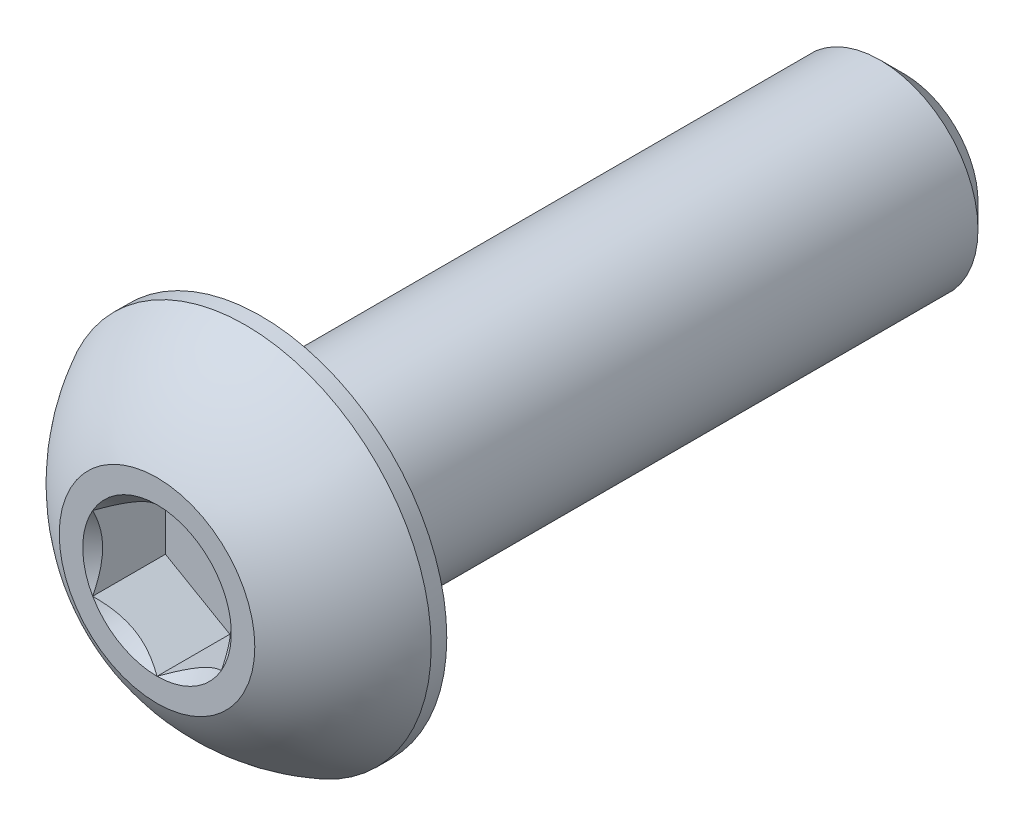
ISO-10303-21;
HEADER;
FILE_DESCRIPTION(('STEP AP214'),'2;1');
FILE_NAME('part.step','',(''),(''),'','','');
FILE_SCHEMA(('AUTOMOTIVE_DESIGN { 1 0 10303 214 1 1 1 1 }'));
ENDSEC;
DATA;
#1=APPLICATION_CONTEXT('core data for automotive mechanical design processes');
#2=APPLICATION_PROTOCOL_DEFINITION('international standard','automotive_design',2000,#1);
#3=PRODUCT_CONTEXT('',#1,'mechanical');
#4=PRODUCT('Part','Part','',(#3));
#5=PRODUCT_RELATED_PRODUCT_CATEGORY('part','',(#4));
#6=PRODUCT_DEFINITION_FORMATION('','',#4);
#7=PRODUCT_DEFINITION_CONTEXT('part definition',#1,'design');
#8=PRODUCT_DEFINITION('design','',#6,#7);
#9=PRODUCT_DEFINITION_SHAPE('','',#8);
#10=(LENGTH_UNIT() NAMED_UNIT(*) SI_UNIT(.MILLI.,.METRE.));
#11=(NAMED_UNIT(*) PLANE_ANGLE_UNIT() SI_UNIT($,.RADIAN.));
#12=(NAMED_UNIT(*) SI_UNIT($,.STERADIAN.) SOLID_ANGLE_UNIT());
#13=UNCERTAINTY_MEASURE_WITH_UNIT(LENGTH_MEASURE(1.E-05),#10,'distance_accuracy_value','');
#14=(GEOMETRIC_REPRESENTATION_CONTEXT(3) GLOBAL_UNCERTAINTY_ASSIGNED_CONTEXT((#13)) GLOBAL_UNIT_ASSIGNED_CONTEXT((#10,
#11,#12)) REPRESENTATION_CONTEXT('',''));
#15=CARTESIAN_POINT('',(0.,0.,0.));
#16=DIRECTION('',(0.,0.,1.));
#17=DIRECTION('',(1.,0.,0.));
#18=AXIS2_PLACEMENT_3D('',#15,#16,#17);
#19=CARTESIAN_POINT('',(0.,-2.41300000000001,-18.4404));
#20=DIRECTION('',(0.,0.,-1.));
#21=DIRECTION('',(0.,1.,0.));
#22=AXIS2_PLACEMENT_3D('',#19,#20,#21);
#23=PLANE('',#22);
#24=CARTESIAN_POINT('',(0.,0.,-18.4404));
#25=DIRECTION('',(0.,0.,-1.));
#26=DIRECTION('',(0.,1.,0.));
#27=AXIS2_PLACEMENT_3D('',#24,#25,#26);
#28=CIRCLE('',#27,1.81768750000001);
#29=CARTESIAN_POINT('',(0.,1.81768750000001,-18.4404));
#30=VERTEX_POINT('',#29);
#31=EDGE_CURVE('E45',#30,#30,#28,.T.);
#32=ORIENTED_EDGE('',*,*,#31,.T.);
#33=EDGE_LOOP('',(#32));
#34=FACE_BOUND('',#33,.T.);
#35=ADVANCED_FACE('F37',(#34),#23,.T.);
#36=CARTESIAN_POINT('',(0.,0.,-18.4404));
#37=DIRECTION('',(0.,0.,-1.));
#38=DIRECTION('',(0.,1.,0.));
#39=AXIS2_PLACEMENT_3D('',#36,#37,#38);
#40=CYLINDRICAL_SURFACE('',#39,2.413);
#41=CARTESIAN_POINT('',(0.,0.,-17.8450875));
#42=DIRECTION('',(0.,0.,-1.));
#43=DIRECTION('',(0.,1.,0.));
#44=AXIS2_PLACEMENT_3D('',#41,#42,#43);
#45=CIRCLE('',#44,2.413);
#46=CARTESIAN_POINT('',(0.,2.413,-17.8450875));
#47=VERTEX_POINT('',#46);
#48=EDGE_CURVE('E11',#47,#47,#45,.F.);
#49=ORIENTED_EDGE('',*,*,#48,.T.);
#50=EDGE_LOOP('',(#49));
#51=FACE_BOUND('',#50,.T.);
#52=CARTESIAN_POINT('',(0.,0.,-2.5654));
#53=DIRECTION('',(0.,0.,1.));
#54=DIRECTION('',(1.,0.,0.));
#55=AXIS2_PLACEMENT_3D('',#52,#53,#54);
#56=CIRCLE('',#55,2.413);
#57=CARTESIAN_POINT('',(2.413,0.,-2.5654));
#58=VERTEX_POINT('',#57);
#59=EDGE_CURVE('E171',#58,#58,#56,.F.);
#60=ORIENTED_EDGE('',*,*,#59,.T.);
#61=EDGE_LOOP('',(#60));
#62=FACE_BOUND('',#61,.T.);
#63=ADVANCED_FACE('F179',(#51,#62),#40,.T.);
#64=CARTESIAN_POINT('',(0.,0.,-18.4404));
#65=DIRECTION('',(0.,0.,1.));
#66=DIRECTION('',(0.,-1.,0.));
#67=AXIS2_PLACEMENT_3D('',#64,#65,#66);
#68=CONICAL_SURFACE('',#67,1.81768750000001,0.785398163397445);
#69=ORIENTED_EDGE('',*,*,#48,.F.);
#70=EDGE_LOOP('',(#69));
#71=FACE_BOUND('',#70,.T.);
#72=ORIENTED_EDGE('',*,*,#31,.F.);
#73=EDGE_LOOP('',(#72));
#74=FACE_BOUND('',#73,.T.);
#75=ADVANCED_FACE('F39',(#71,#74),#68,.T.);
#76=CARTESIAN_POINT('',(0.,0.,-4.5748806144438));
#77=DIRECTION('',(0.,0.,1.));
#78=DIRECTION('',(0.,-1.,0.));
#79=AXIS2_PLACEMENT_3D('',#76,#77,#78);
#80=SPHERICAL_SURFACE('',#79,5.17224338526463);
#81=CARTESIAN_POINT('',(0.,0.,0.));
#82=DIRECTION('',(0.,0.,1.));
#83=DIRECTION('',(1.,0.,0.));
#84=AXIS2_PLACEMENT_3D('',#81,#82,#83);
#85=CIRCLE('',#84,2.413);
#86=CARTESIAN_POINT('',(0.,-2.413,0.));
#87=VERTEX_POINT('',#86);
#88=EDGE_CURVE('E168',#87,#87,#85,.T.);
#89=CARTESIAN_POINT('',(0.,0.,-2.18059));
#90=DIRECTION('',(0.,0.,1.));
#91=DIRECTION('',(1.,0.,0.));
#92=AXIS2_PLACEMENT_3D('',#89,#90,#91);
#93=CIRCLE('',#92,4.5847);
#94=CARTESIAN_POINT('',(0.,-4.5847,-2.18059));
#95=VERTEX_POINT('',#94);
#96=EDGE_CURVE('E162',#95,#95,#93,.T.);
#97=CARTESIAN_POINT('',(0.,-2.413,0.));
#98=CARTESIAN_POINT('',(0.,-2.44179113663083,-0.0151857097788009));
#99=CARTESIAN_POINT('',(0.,-2.47043888331474,-0.0306432741933343));
#100=CARTESIAN_POINT('',(0.,-2.5274374690351,-0.0620964513369402));
#101=CARTESIAN_POINT('',(0.,-2.55578830807155,-0.0780920640660127));
#102=CARTESIAN_POINT('',(0.,-2.61218295074331,-0.110615676881771));
#103=CARTESIAN_POINT('',(0.,-2.64022675437863,-0.127143676968457));
#104=CARTESIAN_POINT('',(0.,-2.69599733629138,-0.160726162390165));
#105=CARTESIAN_POINT('',(0.,-2.72372411456882,-0.177780647725188));
#106=CARTESIAN_POINT('',(0.,-2.77885076121154,-0.21241002764294));
#107=CARTESIAN_POINT('',(0.,-2.80625062957682,-0.229984922225668));
#108=CARTESIAN_POINT('',(0.,-2.86071369040082,-0.265648855453746));
#109=CARTESIAN_POINT('',(0.,-2.88777688285954,-0.283737894099096));
#110=CARTESIAN_POINT('',(0.,-2.94155694533546,-0.320423667994127));
#111=CARTESIAN_POINT('',(0.,-2.96827381535265,-0.339020403243808));
#112=CARTESIAN_POINT('',(0.,-3.02135171000009,-0.37671494166065));
#113=CARTESIAN_POINT('',(0.,-3.04771273463033,-0.39581274482781));
#114=CARTESIAN_POINT('',(0.,-3.10006954235699,-0.434502611862808));
#115=CARTESIAN_POINT('',(0.,-3.12606532545341,-0.454094675730644));
#116=CARTESIAN_POINT('',(0.,-3.17768238416296,-0.493766080756604));
#117=CARTESIAN_POINT('',(0.,-3.20330365977609,-0.513845421914727));
#118=CARTESIAN_POINT('',(0.,-3.25416257105645,-0.554484224430573));
#119=CARTESIAN_POINT('',(0.,-3.27940020672367,-0.575043685788297));
#120=CARTESIAN_POINT('',(0.,-3.32948284239517,-0.616635400476975));
#121=CARTESIAN_POINT('',(0.,-3.35432784239946,-0.63766765380793));
#122=CARTESIAN_POINT('',(0.,-3.40361635097913,-0.680197455694829));
#123=CARTESIAN_POINT('',(0.,-3.42805985955453,-0.701695004250773));
#124=CARTESIAN_POINT('',(0.,-3.47653667261836,-0.745147733989217));
#125=CARTESIAN_POINT('',(0.,-3.5005699771068,-0.767102915171716));
#126=CARTESIAN_POINT('',(0.,-3.54821781555203,-0.81146308444603));
#127=CARTESIAN_POINT('',(0.,-3.57183234950881,-0.833868072537843));
#128=CARTESIAN_POINT('',(0.,-3.61863422971284,-0.879119869584105));
#129=CARTESIAN_POINT('',(0.,-3.64182157596008,-0.901966678538555));
#130=CARTESIAN_POINT('',(0.,-3.68776081583415,-0.948093973780533));
#131=CARTESIAN_POINT('',(0.,-3.71051270946098,-0.971374460068061));
#132=CARTESIAN_POINT('',(0.,-3.75557293439636,-1.01836081186645));
#133=CARTESIAN_POINT('',(0.,-3.7778812657049,-1.0420666773773));
#134=CARTESIAN_POINT('',(0.,-3.82204641440941,-1.08989533789018));
#135=CARTESIAN_POINT('',(0.,-3.84390323180538,-1.11401813289221));
#136=CARTESIAN_POINT('',(0.,-3.88715756202836,-1.16267205404467));
#137=CARTESIAN_POINT('',(0.,-3.90855507485536,-1.18720318019511));
#138=CARTESIAN_POINT('',(0.,-3.95088316899876,-1.23666501975588));
#139=CARTESIAN_POINT('',(0.,-3.97181375031515,-1.26159573316622));
#140=CARTESIAN_POINT('',(0.,-4.01320052092912,-1.31184786092909));
#141=CARTESIAN_POINT('',(0.,-4.03365671022669,-1.33716927528163));
#142=CARTESIAN_POINT('',(0.,-4.07408740538699,-1.38819377934977));
#143=CARTESIAN_POINT('',(0.,-4.09406191124973,-1.41389686906536));
#144=CARTESIAN_POINT('',(0.,-4.13352211981722,-1.46567556223513));
#145=CARTESIAN_POINT('',(0.,-4.15300782252198,-1.4917511656893));
#146=CARTESIAN_POINT('',(0.,-4.19148347927457,-1.54426559193551));
#147=CARTESIAN_POINT('',(0.,-4.2104734333224,-1.57070441472756));
#148=CARTESIAN_POINT('',(0.,-4.24795082398615,-1.6239358557723));
#149=CARTESIAN_POINT('',(0.,-4.26643826060207,-1.65072847402499));
#150=CARTESIAN_POINT('',(0.,-4.3029040266735,-1.70465795604563));
#151=CARTESIAN_POINT('',(0.,-4.32088235612901,-1.73179481981358));
#152=CARTESIAN_POINT('',(0.,-4.35632349988304,-1.78640312007115));
#153=CARTESIAN_POINT('',(0.,-4.37378631418156,-1.81387455656079));
#154=CARTESIAN_POINT('',(0.,-4.40819020238474,-1.86914221075438));
#155=CARTESIAN_POINT('',(0.,-4.42513127628939,-1.89693842845834));
#156=CARTESIAN_POINT('',(0.,-4.45848564813517,-1.95284573578717));
#157=CARTESIAN_POINT('',(0.,-4.4748989460763,-1.98095682541204));
#158=CARTESIAN_POINT('',(0.,-4.50719190474587,-2.03748386259807));
#159=CARTESIAN_POINT('',(0.,-4.5230715654743,-2.06589981015923));
#160=CARTESIAN_POINT('',(0.,-4.55429163018258,-2.12302641242262));
#161=CARTESIAN_POINT('',(0.,-4.56963203416241,-2.15173706712485));
#162=CARTESIAN_POINT('',(0.,-4.5847,-2.18059));
#163=B_SPLINE_CURVE_WITH_KNOTS('',3,(#97,#98,#99,#100,#101,#102,#103,#104,#105,#106,#107,#108,
#109,#110,#111,#112,#113,#114,#115,#116,#117,#118,#119,#120,#121,#122,#123,#124,#125,#126,#127,
#128,#129,#130,#131,#132,#133,#134,#135,#136,#137,#138,#139,#140,#141,#142,#143,#144,#145,#146,
#147,#148,#149,#150,#151,#152,#153,#154,#155,#156,#157,#158,#159,#160,#161,#162),.UNSPECIFIED.,
.F.,.F.,(4,2,2,2,2,2,2,2,2,2,2,2,2,2,2,2,2,2,2,2,2,2,2,2,2,2,2,2,2,2,2,2,4),(0.,
0.0976500604051489,0.195300120810298,0.292950181215447,0.390600241620598,0.488250302025747,
0.585900362430896,0.683550422836046,0.781200483241194,0.878850543646344,0.976500604051493,
1.07415066445664,1.17180072486179,1.26945078526694,1.36710084567209,1.46475090607724,
1.56240096648239,1.66005102688754,1.75770108729269,1.85535114769784,1.95300120810299,
2.05065126850814,2.14830132891329,2.24595138931843,2.34360144972358,2.44125151012873,
2.53890157053388,2.63655163093903,2.73420169134418,2.83185175174933,2.92950181215448,
3.02715187255963,3.12480193296478),.UNSPECIFIED.);
#164=EDGE_CURVE('BSEAM178',#87,#95,#163,.T.);
#165=ORIENTED_EDGE('',*,*,#88,.F.);
#166=ORIENTED_EDGE('',*,*,#96,.T.);
#167=ORIENTED_EDGE('',*,*,#164,.T.);
#168=ORIENTED_EDGE('',*,*,#164,.F.);
#169=EDGE_LOOP('',(#165,#167,#166,#168));
#170=FACE_BOUND('',#169,.T.);
#171=ADVANCED_FACE('F178',(#170),#80,.T.);
#172=CARTESIAN_POINT('',(0.,-2.413,0.));
#173=DIRECTION('',(0.,0.,-1.));
#174=DIRECTION('',(-1.,0.,0.));
#175=AXIS2_PLACEMENT_3D('',#172,#173,#174);
#176=PLANE('',#175);
#177=CARTESIAN_POINT('',(0.,0.,0.));
#178=DIRECTION('',(0.,0.,1.));
#179=DIRECTION('',(1.,0.,0.));
#180=AXIS2_PLACEMENT_3D('',#177,#178,#179);
#181=CIRCLE('',#180,1.83308710467706);
#182=CARTESIAN_POINT('',(-1.5875,0.91654355233853,0.));
#183=VERTEX_POINT('',#182);
#184=CARTESIAN_POINT('',(-1.5875,-0.916543552338531,0.));
#185=VERTEX_POINT('',#184);
#186=EDGE_CURVE('E58',#183,#185,#181,.T.);
#187=ORIENTED_EDGE('',*,*,#186,.F.);
#188=CARTESIAN_POINT('',(0.,1.83308710467706,0.));
#189=VERTEX_POINT('',#188);
#190=EDGE_CURVE('E132',#189,#183,#181,.T.);
#191=ORIENTED_EDGE('',*,*,#190,.F.);
#192=CARTESIAN_POINT('',(1.5875,0.916543552338531,0.));
#193=VERTEX_POINT('',#192);
#194=EDGE_CURVE('E109',#193,#189,#181,.T.);
#195=ORIENTED_EDGE('',*,*,#194,.F.);
#196=CARTESIAN_POINT('',(1.5875,-0.916543552338531,0.));
#197=VERTEX_POINT('',#196);
#198=EDGE_CURVE('E98',#197,#193,#181,.T.);
#199=ORIENTED_EDGE('',*,*,#198,.F.);
#200=CARTESIAN_POINT('',(0.,-1.83308710467706,0.));
#201=VERTEX_POINT('',#200);
#202=EDGE_CURVE('E90',#201,#197,#181,.T.);
#203=ORIENTED_EDGE('',*,*,#202,.F.);
#204=EDGE_CURVE('E51',#185,#201,#181,.T.);
#205=ORIENTED_EDGE('',*,*,#204,.F.);
#206=EDGE_LOOP('',(#187,#191,#195,#199,#203,#205));
#207=FACE_BOUND('',#206,.T.);
#208=ORIENTED_EDGE('',*,*,#88,.T.);
#209=EDGE_LOOP('',(#208));
#210=FACE_BOUND('',#209,.T.);
#211=ADVANCED_FACE('F129',(#207,#210),#176,.F.);
#212=CARTESIAN_POINT('',(0.,-4.5847,-2.5654));
#213=DIRECTION('',(0.,0.,1.));
#214=DIRECTION('',(1.,0.,0.));
#215=AXIS2_PLACEMENT_3D('',#212,#213,#214);
#216=PLANE('',#215);
#217=ORIENTED_EDGE('',*,*,#59,.F.);
#218=EDGE_LOOP('',(#217));
#219=FACE_BOUND('',#218,.T.);
#220=CARTESIAN_POINT('',(0.,0.,-2.5654));
#221=DIRECTION('',(0.,0.,1.));
#222=DIRECTION('',(1.,0.,0.));
#223=AXIS2_PLACEMENT_3D('',#220,#221,#222);
#224=CIRCLE('',#223,4.5847);
#225=CARTESIAN_POINT('',(4.5847,0.,-2.5654));
#226=VERTEX_POINT('',#225);
#227=EDGE_CURVE('E165',#226,#226,#224,.T.);
#228=ORIENTED_EDGE('',*,*,#227,.F.);
#229=EDGE_LOOP('',(#228));
#230=FACE_BOUND('',#229,.T.);
#231=ADVANCED_FACE('F196',(#219,#230),#216,.F.);
#232=CARTESIAN_POINT('',(0.,0.,0.));
#233=DIRECTION('',(0.,0.,1.));
#234=DIRECTION('',(1.,0.,0.));
#235=AXIS2_PLACEMENT_3D('',#232,#233,#234);
#236=CYLINDRICAL_SURFACE('',#235,4.5847);
#237=ORIENTED_EDGE('',*,*,#96,.F.);
#238=EDGE_LOOP('',(#237));
#239=FACE_BOUND('',#238,.T.);
#240=ORIENTED_EDGE('',*,*,#227,.T.);
#241=EDGE_LOOP('',(#240));
#242=FACE_BOUND('',#241,.T.);
#243=ADVANCED_FACE('F199',(#239,#242),#236,.T.);
#244=CARTESIAN_POINT('',(0.,0.,0.));
#245=DIRECTION('',(0.,0.,1.));
#246=DIRECTION('',(1.,0.,0.));
#247=AXIS2_PLACEMENT_3D('',#244,#245,#246);
#248=CONICAL_SURFACE('',#247,1.83308710467706,0.78539816339745);
#249=ORIENTED_EDGE('',*,*,#198,.T.);
#250=CARTESIAN_POINT('',(1.5875,-1.83163614232865,0.590762562254565));
#251=CARTESIAN_POINT('',(1.5875,-1.78705354844902,0.55707785480324));
#252=CARTESIAN_POINT('',(1.5875,-1.74222294150555,0.523722329968627));
#253=CARTESIAN_POINT('',(1.5875,-1.65196486784504,0.457805675888285));
#254=CARTESIAN_POINT('',(1.5875,-1.60653725449665,0.425244747634468));
#255=CARTESIAN_POINT('',(1.5875,-1.46854281940082,0.328493449461236));
#256=CARTESIAN_POINT('',(1.5875,-1.37494211623386,0.265753264612858));
#257=CARTESIAN_POINT('',(1.5875,-1.17864136265695,0.142553151294645));
#258=CARTESIAN_POINT('',(1.5875,-1.07572731596385,0.0824303289226488));
#259=CARTESIAN_POINT('',(1.5875,-0.864754189558117,-0.0275706334490079));
#260=CARTESIAN_POINT('',(1.5875,-0.756714033301438,-0.0774833149376714));
#261=CARTESIAN_POINT('',(1.5875,-0.594580029688666,-0.138547963751185));
#262=CARTESIAN_POINT('',(1.5875,-0.542894373932897,-0.156067797502568));
#263=CARTESIAN_POINT('',(1.5875,-0.43827206291756,-0.186958420156953));
#264=CARTESIAN_POINT('',(1.5875,-0.3853353220534,-0.200328924255393));
#265=CARTESIAN_POINT('',(1.5875,-0.27941340073437,-0.222002681044568));
#266=CARTESIAN_POINT('',(1.5875,-0.226446313904206,-0.230392976800141));
#267=CARTESIAN_POINT('',(1.5875,-0.119941637592404,-0.241941911012322));
#268=CARTESIAN_POINT('',(1.5875,-0.0664041486263234,-0.245101456366562));
#269=CARTESIAN_POINT('',(1.5875,0.0387581192420279,-0.245952982965122));
#270=CARTESIAN_POINT('',(1.5875,0.090381381554216,-0.243840334608509));
#271=CARTESIAN_POINT('',(1.5875,0.19318730201683,-0.234695846678065));
#272=CARTESIAN_POINT('',(1.5875,0.244369916988517,-0.227663530460197));
#273=CARTESIAN_POINT('',(1.5875,0.346790527788956,-0.208944949355169));
#274=CARTESIAN_POINT('',(1.5875,0.398013804172139,-0.197179358640977));
#275=CARTESIAN_POINT('',(1.5875,0.499340680307276,-0.169620657149212));
#276=CARTESIAN_POINT('',(1.5875,0.549444372105894,-0.153827878801824));
#277=CARTESIAN_POINT('',(1.5875,0.707022639586407,-0.0982133790717417));
#278=CARTESIAN_POINT('',(1.5875,0.812258737570578,-0.0520647672653368));
#279=CARTESIAN_POINT('',(1.5875,1.01778869013701,0.0505458403808823));
#280=CARTESIAN_POINT('',(1.5875,1.11806310933257,0.107044855107553));
#281=CARTESIAN_POINT('',(1.5875,1.30970442577157,0.223612502972616));
#282=CARTESIAN_POINT('',(1.5875,1.40126637149297,0.283364441978613));
#283=CARTESIAN_POINT('',(1.5875,1.53616443073864,0.37573700869171));
#284=CARTESIAN_POINT('',(1.5875,1.58054835823549,0.406854014274728));
#285=CARTESIAN_POINT('',(1.5875,1.66870952512132,0.469911550181166));
#286=CARTESIAN_POINT('',(1.5875,1.71248692801697,0.501851851647461));
#287=CARTESIAN_POINT('',(1.5875,1.75601179240957,0.534133557847131));
#288=B_SPLINE_CURVE_WITH_KNOTS('',3,(#250,#251,#252,#253,#254,#255,#256,#257,#258,#259,#260,
#261,#262,#263,#264,#265,#266,#267,#268,#269,#270,#271,#272,#273,#274,#275,#276,#277,#278,#279,
#280,#281,#282,#283,#284,#285,#286,#287),.UNSPECIFIED.,.F.,.F.,(4,2,2,2,2,2,2,2,2,2,2,2,2,2,2,2,
2,2,4),(0.,0.167627505127548,0.33529698084648,0.673194674702938,1.0304700708717,
1.38651603079307,1.55010049300858,1.71369618096554,1.87434127467533,2.034958513124,
2.18971280484453,2.34448209207484,2.50196108385089,2.65942708049529,3.00314617711216,
3.34811949873714,3.6759579216973,3.83856722085481,4.00113179576279),.UNSPECIFIED.);
#289=EDGE_CURVE('E103',#197,#193,#288,.T.);
#290=ORIENTED_EDGE('',*,*,#289,.F.);
#291=EDGE_LOOP('',(#249,#290));
#292=FACE_BOUND('',#291,.T.);
#293=ADVANCED_FACE('F104',(#292),#248,.F.);
#294=ORIENTED_EDGE('',*,*,#194,.T.);
#295=CARTESIAN_POINT('',(1.5877,0.916428082284693,0.000115480963706964));
#296=CARTESIAN_POINT('',(1.53312479190086,0.947937093371809,-0.0313691916294028));
#297=CARTESIAN_POINT('',(1.47763696320971,0.979973006203395,-0.0610049539864698));
#298=CARTESIAN_POINT('',(1.36449087915364,1.04529792829092,-0.115267739979175));
#299=CARTESIAN_POINT('',(1.30682185887062,1.07859315267522,-0.139864564866823));
#300=CARTESIAN_POINT('',(1.1905349781269,1.14573141457583,-0.181999635727418));
#301=CARTESIAN_POINT('',(1.13194674474407,1.17955734689075,-0.199643807270178));
#302=CARTESIAN_POINT('',(1.01348022674557,1.24795402294714,-0.226828529915031));
#303=CARTESIAN_POINT('',(0.953605562983896,1.28252267618758,-0.236389379304923));
#304=CARTESIAN_POINT('',(0.850418771876558,1.34209759781022,-0.245015586895992));
#305=CARTESIAN_POINT('',(0.807240015952288,1.36702686416637,-0.246292807190424));
#306=CARTESIAN_POINT('',(0.720953038535399,1.41684467380557,-0.244142944185295));
#307=CARTESIAN_POINT('',(0.677844847078612,1.44173319974742,-0.240714211450657));
#308=CARTESIAN_POINT('',(0.592046335002031,1.49126899379091,-0.229349005566657));
#309=CARTESIAN_POINT('',(0.549356408925407,1.51591603410293,-0.221408628198358));
#310=CARTESIAN_POINT('',(0.464693063478359,1.56479643938728,-0.201451585548899));
#311=CARTESIAN_POINT('',(0.422719959755075,1.58902962212064,-0.189433170791309));
#312=CARTESIAN_POINT('',(0.315211458113566,1.65109968448354,-0.153753102752754));
#313=CARTESIAN_POINT('',(0.2503427717089,1.68855163804125,-0.127401427696863));
#314=CARTESIAN_POINT('',(0.154961599380924,1.74361998356043,-0.082916463148298));
#315=CARTESIAN_POINT('',(0.123530699536157,1.76176662204668,-0.0672871421988686));
#316=CARTESIAN_POINT('',(0.0612469855696368,1.79772614107138,-0.0346015121388987));
#317=CARTESIAN_POINT('',(0.0303939039605763,1.8155391760437,-0.0175458843430302));
#318=CARTESIAN_POINT('',(-0.000200000000000412,1.8332025747309,0.000115480963706783));
#319=B_SPLINE_CURVE_WITH_KNOTS('',3,(#295,#296,#297,#298,#299,#300,#301,#302,#303,#304,#305,
#306,#307,#308,#309,#310,#311,#312,#313,#314,#315,#316,#317,#318),.UNSPECIFIED.,.F.,.F.,(4,2,2,
2,2,2,2,2,2,2,2,4),(0.,0.211482650810816,0.424197870807275,0.633533884524815,0.842342653263348,
0.99175555372714,1.14122083674204,1.29081565918877,1.44047473906437,1.6781878086972,
1.79671410024894,1.91518409436631),.UNSPECIFIED.);
#320=EDGE_CURVE('E108',#193,#189,#319,.T.);
#321=ORIENTED_EDGE('',*,*,#320,.F.);
#322=EDGE_LOOP('',(#294,#321));
#323=FACE_BOUND('',#322,.T.);
#324=ADVANCED_FACE('F284',(#323),#248,.F.);
#325=ORIENTED_EDGE('',*,*,#190,.T.);
#326=CARTESIAN_POINT('',(0.000199999999999602,1.8332025747309,0.000115480963706835));
#327=CARTESIAN_POINT('',(-0.0543752080991368,1.80169356364378,-0.031369191629403));
#328=CARTESIAN_POINT('',(-0.10986303679029,1.7696576508122,-0.06100495398647));
#329=CARTESIAN_POINT('',(-0.223009120846359,1.70433272872467,-0.115267739979175));
#330=CARTESIAN_POINT('',(-0.280678141129381,1.67103750434037,-0.139864564866824));
#331=CARTESIAN_POINT('',(-0.396965021873103,1.60389924243976,-0.181999635727418));
#332=CARTESIAN_POINT('',(-0.455553255255931,1.57007331012484,-0.199643807270178));
#333=CARTESIAN_POINT('',(-0.574019773254431,1.50167663406845,-0.226828529915031));
#334=CARTESIAN_POINT('',(-0.633894437016105,1.46710798082801,-0.236389379304923));
#335=CARTESIAN_POINT('',(-0.737081228123443,1.40753305920537,-0.245015586895992));
#336=CARTESIAN_POINT('',(-0.780259984047713,1.38260379284922,-0.246292807190424));
#337=CARTESIAN_POINT('',(-0.866546961464602,1.33278598321002,-0.244142944185295));
#338=CARTESIAN_POINT('',(-0.909655152921388,1.30789745726817,-0.240714211450657));
#339=CARTESIAN_POINT('',(-0.99545366499797,1.25836166322468,-0.229349005566657));
#340=CARTESIAN_POINT('',(-1.03814359107459,1.23371462291266,-0.221408628198358));
#341=CARTESIAN_POINT('',(-1.12280693652164,1.18483421762831,-0.201451585548899));
#342=CARTESIAN_POINT('',(-1.16478004024493,1.16060103489495,-0.189433170791309));
#343=CARTESIAN_POINT('',(-1.27228854188643,1.09853097253205,-0.153753102752754));
#344=CARTESIAN_POINT('',(-1.3371572282911,1.06107901897434,-0.127401427696863));
#345=CARTESIAN_POINT('',(-1.43253840061908,1.00601067345516,-0.082916463148298));
#346=CARTESIAN_POINT('',(-1.46396930046384,0.987864034968913,-0.0672871421988685));
#347=CARTESIAN_POINT('',(-1.52625301443036,0.951904515944214,-0.0346015121388985));
#348=CARTESIAN_POINT('',(-1.55710609603942,0.934091480971893,-0.0175458843430301));
#349=CARTESIAN_POINT('',(-1.5877,0.916428082284692,0.000115480963706555));
#350=B_SPLINE_CURVE_WITH_KNOTS('',3,(#326,#327,#328,#329,#330,#331,#332,#333,#334,#335,#336,
#337,#338,#339,#340,#341,#342,#343,#344,#345,#346,#347,#348,#349),.UNSPECIFIED.,.F.,.F.,(4,2,2,
2,2,2,2,2,2,2,2,4),(0.,0.211482650810816,0.424197870807276,0.633533884524816,0.842342653263348,
0.991755553727141,1.14122083674205,1.29081565918877,1.44047473906438,1.6781878086972,
1.79671410024894,1.91518409436631),.UNSPECIFIED.);
#351=EDGE_CURVE('E139',#189,#183,#350,.T.);
#352=ORIENTED_EDGE('',*,*,#351,.F.);
#353=EDGE_LOOP('',(#325,#352));
#354=FACE_BOUND('',#353,.T.);
#355=ADVANCED_FACE('F137',(#354),#248,.F.);
#356=ORIENTED_EDGE('',*,*,#186,.T.);
#357=CARTESIAN_POINT('',(-1.5875,-1.83163614232865,0.590762562254564));
#358=CARTESIAN_POINT('',(-1.5875,-1.78705354844902,0.557077854803239));
#359=CARTESIAN_POINT('',(-1.5875,-1.74222294150555,0.523722329968626));
#360=CARTESIAN_POINT('',(-1.5875,-1.65196486784504,0.457805675888285));
#361=CARTESIAN_POINT('',(-1.5875,-1.60653725449665,0.425244747634468));
#362=CARTESIAN_POINT('',(-1.5875,-1.46854281940082,0.328493449461235));
#363=CARTESIAN_POINT('',(-1.5875,-1.37494211623386,0.265753264612857));
#364=CARTESIAN_POINT('',(-1.5875,-1.17864136265695,0.142553151294644));
#365=CARTESIAN_POINT('',(-1.5875,-1.07572731596385,0.0824303289226486));
#366=CARTESIAN_POINT('',(-1.5875,-0.864754189558117,-0.0275706334490081));
#367=CARTESIAN_POINT('',(-1.5875,-0.756714033301438,-0.0774833149376718));
#368=CARTESIAN_POINT('',(-1.5875,-0.594580029688666,-0.138547963751185));
#369=CARTESIAN_POINT('',(-1.5875,-0.542894373932898,-0.156067797502568));
#370=CARTESIAN_POINT('',(-1.5875,-0.438272062917561,-0.186958420156953));
#371=CARTESIAN_POINT('',(-1.5875,-0.385335322053401,-0.200328924255393));
#372=CARTESIAN_POINT('',(-1.5875,-0.27941340073437,-0.222002681044568));
#373=CARTESIAN_POINT('',(-1.5875,-0.226446313904207,-0.230392976800141));
#374=CARTESIAN_POINT('',(-1.5875,-0.119941637592405,-0.241941911012322));
#375=CARTESIAN_POINT('',(-1.5875,-0.0664041486263238,-0.245101456366562));
#376=CARTESIAN_POINT('',(-1.5875,0.0387581192420274,-0.245952982965122));
#377=CARTESIAN_POINT('',(-1.5875,0.0903813815542156,-0.243840334608509));
#378=CARTESIAN_POINT('',(-1.5875,0.193187302016829,-0.234695846678065));
#379=CARTESIAN_POINT('',(-1.5875,0.244369916988516,-0.227663530460197));
#380=CARTESIAN_POINT('',(-1.5875,0.346790527788956,-0.208944949355169));
#381=CARTESIAN_POINT('',(-1.5875,0.398013804172139,-0.197179358640977));
#382=CARTESIAN_POINT('',(-1.5875,0.499340680307276,-0.169620657149213));
#383=CARTESIAN_POINT('',(-1.5875,0.549444372105893,-0.153827878801824));
#384=CARTESIAN_POINT('',(-1.5875,0.707022639586407,-0.0982133790717423));
#385=CARTESIAN_POINT('',(-1.5875,0.812258737570577,-0.0520647672653372));
#386=CARTESIAN_POINT('',(-1.5875,1.01778869013701,0.050545840380882));
#387=CARTESIAN_POINT('',(-1.5875,1.11806310933256,0.107044855107552));
#388=CARTESIAN_POINT('',(-1.5875,1.30970442577157,0.223612502972616));
#389=CARTESIAN_POINT('',(-1.5875,1.40126637149297,0.283364441978612));
#390=CARTESIAN_POINT('',(-1.5875,1.53616443073864,0.375737008691709));
#391=CARTESIAN_POINT('',(-1.5875,1.58054835823549,0.406854014274727));
#392=CARTESIAN_POINT('',(-1.5875,1.66870952512132,0.469911550181165));
#393=CARTESIAN_POINT('',(-1.5875,1.71248692801697,0.50185185164746));
#394=CARTESIAN_POINT('',(-1.5875,1.75601179240957,0.53413355784713));
#395=B_SPLINE_CURVE_WITH_KNOTS('',3,(#357,#358,#359,#360,#361,#362,#363,#364,#365,#366,#367,
#368,#369,#370,#371,#372,#373,#374,#375,#376,#377,#378,#379,#380,#381,#382,#383,#384,#385,#386,
#387,#388,#389,#390,#391,#392,#393,#394),.UNSPECIFIED.,.F.,.F.,(4,2,2,2,2,2,2,2,2,2,2,2,2,2,2,2,
2,2,4),(0.,0.167627505127548,0.335296980846479,0.673194674702938,1.0304700708717,
1.38651603079307,1.55010049300858,1.71369618096554,1.87434127467533,2.034958513124,
2.18971280484453,2.34448209207484,2.50196108385089,2.65942708049529,3.00314617711216,
3.34811949873714,3.67595792169729,3.83856722085481,4.00113179576279),.UNSPECIFIED.);
#396=EDGE_CURVE('E143',#183,#185,#395,.F.);
#397=ORIENTED_EDGE('',*,*,#396,.F.);
#398=EDGE_LOOP('',(#356,#397));
#399=FACE_BOUND('',#398,.T.);
#400=ADVANCED_FACE('F278',(#399),#248,.F.);
#401=ORIENTED_EDGE('',*,*,#204,.T.);
#402=CARTESIAN_POINT('',(-1.5877,-0.916428082284693,0.000115480963706531));
#403=CARTESIAN_POINT('',(-1.53312479190086,-0.947937093371809,-0.0313691916294031));
#404=CARTESIAN_POINT('',(-1.47763696320971,-0.979973006203394,-0.06100495398647));
#405=CARTESIAN_POINT('',(-1.36449087915364,-1.04529792829092,-0.115267739979175));
#406=CARTESIAN_POINT('',(-1.30682185887062,-1.07859315267522,-0.139864564866824));
#407=CARTESIAN_POINT('',(-1.1905349781269,-1.14573141457583,-0.181999635727418));
#408=CARTESIAN_POINT('',(-1.13194674474407,-1.17955734689075,-0.199643807270178));
#409=CARTESIAN_POINT('',(-1.01348022674557,-1.24795402294714,-0.226828529915031));
#410=CARTESIAN_POINT('',(-0.953605562983895,-1.28252267618758,-0.236389379304923));
#411=CARTESIAN_POINT('',(-0.850418771876558,-1.34209759781022,-0.245015586895992));
#412=CARTESIAN_POINT('',(-0.807240015952288,-1.36702686416637,-0.246292807190424));
#413=CARTESIAN_POINT('',(-0.720953038535399,-1.41684467380557,-0.244142944185295));
#414=CARTESIAN_POINT('',(-0.677844847078612,-1.44173319974742,-0.240714211450657));
#415=CARTESIAN_POINT('',(-0.592046335002031,-1.49126899379091,-0.229349005566657));
#416=CARTESIAN_POINT('',(-0.549356408925407,-1.51591603410293,-0.221408628198358));
#417=CARTESIAN_POINT('',(-0.464693063478359,-1.56479643938728,-0.201451585548899));
#418=CARTESIAN_POINT('',(-0.422719959755075,-1.58902962212064,-0.189433170791309));
#419=CARTESIAN_POINT('',(-0.315211458113566,-1.65109968448354,-0.153753102752754));
#420=CARTESIAN_POINT('',(-0.2503427717089,-1.68855163804125,-0.127401427696864));
#421=CARTESIAN_POINT('',(-0.154961599380924,-1.74361998356043,-0.082916463148298));
#422=CARTESIAN_POINT('',(-0.123530699536156,-1.76176662204668,-0.0672871421988684));
#423=CARTESIAN_POINT('',(-0.0612469855696366,-1.79772614107138,-0.0346015121388983));
#424=CARTESIAN_POINT('',(-0.030393903960576,-1.8155391760437,-0.0175458843430298));
#425=CARTESIAN_POINT('',(0.000200000000000753,-1.8332025747309,0.000115480963706965));
#426=B_SPLINE_CURVE_WITH_KNOTS('',3,(#402,#403,#404,#405,#406,#407,#408,#409,#410,#411,#412,
#413,#414,#415,#416,#417,#418,#419,#420,#421,#422,#423,#424,#425),.UNSPECIFIED.,.F.,.F.,(4,2,2,
2,2,2,2,2,2,2,2,4),(0.,0.211482650810816,0.424197870807275,0.633533884524815,0.842342653263347,
0.99175555372714,1.14122083674204,1.29081565918877,1.44047473906437,1.6781878086972,
1.79671410024894,1.91518409436631),.UNSPECIFIED.);
#427=EDGE_CURVE('E119',#185,#201,#426,.T.);
#428=ORIENTED_EDGE('',*,*,#427,.F.);
#429=EDGE_LOOP('',(#401,#428));
#430=FACE_BOUND('',#429,.T.);
#431=ADVANCED_FACE('F226',(#430),#248,.F.);
#432=ORIENTED_EDGE('',*,*,#202,.T.);
#433=CARTESIAN_POINT('',(-0.000199999999999123,-1.8332025747309,0.000115480963707269));
#434=CARTESIAN_POINT('',(0.0543752080991372,-1.80169356364378,-0.0313691916294027));
#435=CARTESIAN_POINT('',(0.109863036790291,-1.7696576508122,-0.0610049539864697));
#436=CARTESIAN_POINT('',(0.22300912084636,-1.70433272872467,-0.115267739979174));
#437=CARTESIAN_POINT('',(0.280678141129382,-1.67103750434037,-0.139864564866823));
#438=CARTESIAN_POINT('',(0.396965021873104,-1.60389924243976,-0.181999635727418));
#439=CARTESIAN_POINT('',(0.455553255255932,-1.57007331012484,-0.199643807270178));
#440=CARTESIAN_POINT('',(0.574019773254432,-1.50167663406845,-0.226828529915031));
#441=CARTESIAN_POINT('',(0.633894437016106,-1.46710798082801,-0.236389379304922));
#442=CARTESIAN_POINT('',(0.737081228123443,-1.40753305920537,-0.245015586895992));
#443=CARTESIAN_POINT('',(0.780259984047713,-1.38260379284922,-0.246292807190423));
#444=CARTESIAN_POINT('',(0.866546961464602,-1.33278598321002,-0.244142944185295));
#445=CARTESIAN_POINT('',(0.909655152921389,-1.30789745726817,-0.240714211450656));
#446=CARTESIAN_POINT('',(0.99545366499797,-1.25836166322468,-0.229349005566656));
#447=CARTESIAN_POINT('',(1.03814359107459,-1.23371462291266,-0.221408628198358));
#448=CARTESIAN_POINT('',(1.12280693652164,-1.18483421762831,-0.201451585548898));
#449=CARTESIAN_POINT('',(1.16478004024493,-1.16060103489495,-0.189433170791309));
#450=CARTESIAN_POINT('',(1.27228854188643,-1.09853097253205,-0.153753102752754));
#451=CARTESIAN_POINT('',(1.3371572282911,-1.06107901897434,-0.127401427696863));
#452=CARTESIAN_POINT('',(1.43253840061908,-1.00601067345516,-0.0829164631482976));
#453=CARTESIAN_POINT('',(1.46396930046384,-0.987864034968914,-0.0672871421988682));
#454=CARTESIAN_POINT('',(1.52625301443036,-0.951904515944214,-0.0346015121388983));
#455=CARTESIAN_POINT('',(1.55710609603942,-0.934091480971893,-0.0175458843430299));
#456=CARTESIAN_POINT('',(1.5877,-0.916428082284693,0.000115480963706771));
#457=B_SPLINE_CURVE_WITH_KNOTS('',3,(#433,#434,#435,#436,#437,#438,#439,#440,#441,#442,#443,
#444,#445,#446,#447,#448,#449,#450,#451,#452,#453,#454,#455,#456),.UNSPECIFIED.,.F.,.F.,(4,2,2,
2,2,2,2,2,2,2,2,4),(0.,0.211482650810816,0.424197870807276,0.633533884524815,0.842342653263348,
0.991755553727141,1.14122083674205,1.29081565918877,1.44047473906438,1.6781878086972,
1.79671410024894,1.91518409436631),.UNSPECIFIED.);
#458=EDGE_CURVE('E94',#201,#197,#457,.T.);
#459=ORIENTED_EDGE('',*,*,#458,.F.);
#460=EDGE_LOOP('',(#432,#459));
#461=FACE_BOUND('',#460,.T.);
#462=ADVANCED_FACE('F92',(#461),#248,.F.);
#463=CARTESIAN_POINT('',(1.5875,-0.916543552338531,-1.79578));
#464=DIRECTION('',(0.,0.,1.));
#465=DIRECTION('',(1.,0.,0.));
#466=AXIS2_PLACEMENT_3D('',#463,#464,#465);
#467=PLANE('',#466);
#468=DIRECTION('',(0.866025403784438,0.5,0.));
#469=VECTOR('',#468,1.);
#470=CARTESIAN_POINT('',(0.,-1.83308710467706,-1.79578));
#471=LINE('',#470,#469);
#472=CARTESIAN_POINT('',(0.,-1.83308710467706,-1.79578));
#473=VERTEX_POINT('',#472);
#474=CARTESIAN_POINT('',(1.5875,-0.916543552338531,-1.79578));
#475=VERTEX_POINT('',#474);
#476=EDGE_CURVE('E118',#473,#475,#471,.T.);
#477=ORIENTED_EDGE('',*,*,#476,.T.);
#478=DIRECTION('',(0.,1.,0.));
#479=VECTOR('',#478,1.);
#480=CARTESIAN_POINT('',(1.5875,-0.916543552338531,-1.79578));
#481=LINE('',#480,#479);
#482=CARTESIAN_POINT('',(1.5875,0.916543552338531,-1.79578));
#483=VERTEX_POINT('',#482);
#484=EDGE_CURVE('E123',#475,#483,#481,.T.);
#485=ORIENTED_EDGE('',*,*,#484,.T.);
#486=DIRECTION('',(-0.866025403784439,0.5,0.));
#487=VECTOR('',#486,1.);
#488=CARTESIAN_POINT('',(1.5875,0.916543552338531,-1.79578));
#489=LINE('',#488,#487);
#490=CARTESIAN_POINT('',(0.,1.83308710467706,-1.79578));
#491=VERTEX_POINT('',#490);
#492=EDGE_CURVE('E268',#483,#491,#489,.T.);
#493=ORIENTED_EDGE('',*,*,#492,.T.);
#494=DIRECTION('',(-0.866025403784438,-0.5,0.));
#495=VECTOR('',#494,1.);
#496=CARTESIAN_POINT('',(0.,1.83308710467706,-1.79578));
#497=LINE('',#496,#495);
#498=CARTESIAN_POINT('',(-1.5875,0.91654355233853,-1.79578));
#499=VERTEX_POINT('',#498);
#500=EDGE_CURVE('E153',#491,#499,#497,.T.);
#501=ORIENTED_EDGE('',*,*,#500,.T.);
#502=DIRECTION('',(0.,-1.,0.));
#503=VECTOR('',#502,1.);
#504=CARTESIAN_POINT('',(-1.5875,0.91654355233853,-1.79578));
#505=LINE('',#504,#503);
#506=CARTESIAN_POINT('',(-1.5875,-0.916543552338531,-1.79578));
#507=VERTEX_POINT('',#506);
#508=EDGE_CURVE('E272',#499,#507,#505,.T.);
#509=ORIENTED_EDGE('',*,*,#508,.T.);
#510=DIRECTION('',(0.866025403784439,-0.5,0.));
#511=VECTOR('',#510,1.);
#512=CARTESIAN_POINT('',(-1.5875,-0.916543552338531,-1.79578));
#513=LINE('',#512,#511);
#514=EDGE_CURVE('E126',#507,#473,#513,.T.);
#515=ORIENTED_EDGE('',*,*,#514,.T.);
#516=EDGE_LOOP('',(#477,#485,#493,#501,#509,#515));
#517=FACE_BOUND('',#516,.T.);
#518=ADVANCED_FACE('F225',(#517),#467,.T.);
#519=CARTESIAN_POINT('',(1.5875,-0.916543552338531,-1.79578));
#520=DIRECTION('',(1.,0.,0.));
#521=DIRECTION('',(0.,0.,-1.));
#522=AXIS2_PLACEMENT_3D('',#519,#520,#521);
#523=PLANE('',#522);
#524=DIRECTION('',(0.,0.,1.));
#525=VECTOR('',#524,1.);
#526=CARTESIAN_POINT('',(1.5875,-0.916543552338531,-1.79578));
#527=LINE('',#526,#525);
#528=EDGE_CURVE('E115',#475,#197,#527,.T.);
#529=ORIENTED_EDGE('',*,*,#528,.T.);
#530=ORIENTED_EDGE('',*,*,#289,.T.);
#531=DIRECTION('',(0.,0.,1.));
#532=VECTOR('',#531,1.);
#533=CARTESIAN_POINT('',(1.5875,0.916543552338531,-1.79578));
#534=LINE('',#533,#532);
#535=EDGE_CURVE('E125',#483,#193,#534,.T.);
#536=ORIENTED_EDGE('',*,*,#535,.F.);
#537=ORIENTED_EDGE('',*,*,#484,.F.);
#538=EDGE_LOOP('',(#529,#530,#536,#537));
#539=FACE_BOUND('',#538,.T.);
#540=ADVANCED_FACE('F121',(#539),#523,.F.);
#541=CARTESIAN_POINT('',(1.5875,0.916543552338531,-1.79578));
#542=DIRECTION('',(0.5,0.866025403784439,0.));
#543=DIRECTION('',(-0.866025403784439,0.5,0.));
#544=AXIS2_PLACEMENT_3D('',#541,#542,#543);
#545=PLANE('',#544);
#546=ORIENTED_EDGE('',*,*,#535,.T.);
#547=ORIENTED_EDGE('',*,*,#320,.T.);
#548=DIRECTION('',(0.,0.,1.));
#549=VECTOR('',#548,1.);
#550=CARTESIAN_POINT('',(0.,1.83308710467706,-1.79578));
#551=LINE('',#550,#549);
#552=EDGE_CURVE('E148',#491,#189,#551,.T.);
#553=ORIENTED_EDGE('',*,*,#552,.F.);
#554=ORIENTED_EDGE('',*,*,#492,.F.);
#555=EDGE_LOOP('',(#546,#547,#553,#554));
#556=FACE_BOUND('',#555,.T.);
#557=ADVANCED_FACE('F146',(#556),#545,.F.);
#558=CARTESIAN_POINT('',(0.,1.83308710467706,-1.79578));
#559=DIRECTION('',(-0.5,0.866025403784438,0.));
#560=DIRECTION('',(-0.866025403784439,-0.5,0.));
#561=AXIS2_PLACEMENT_3D('',#558,#559,#560);
#562=PLANE('',#561);
#563=ORIENTED_EDGE('',*,*,#552,.T.);
#564=ORIENTED_EDGE('',*,*,#351,.T.);
#565=DIRECTION('',(0.,0.,1.));
#566=VECTOR('',#565,1.);
#567=CARTESIAN_POINT('',(-1.5875,0.91654355233853,-1.79578));
#568=LINE('',#567,#566);
#569=EDGE_CURVE('E155',#499,#183,#568,.T.);
#570=ORIENTED_EDGE('',*,*,#569,.F.);
#571=ORIENTED_EDGE('',*,*,#500,.F.);
#572=EDGE_LOOP('',(#563,#564,#570,#571));
#573=FACE_BOUND('',#572,.T.);
#574=ADVANCED_FACE('F151',(#573),#562,.F.);
#575=CARTESIAN_POINT('',(-1.5875,0.91654355233853,-1.79578));
#576=DIRECTION('',(-1.,0.,0.));
#577=DIRECTION('',(0.,-1.,0.));
#578=AXIS2_PLACEMENT_3D('',#575,#576,#577);
#579=PLANE('',#578);
#580=ORIENTED_EDGE('',*,*,#569,.T.);
#581=ORIENTED_EDGE('',*,*,#396,.T.);
#582=DIRECTION('',(0.,0.,1.));
#583=VECTOR('',#582,1.);
#584=CARTESIAN_POINT('',(-1.5875,-0.916543552338531,-1.79578));
#585=LINE('',#584,#583);
#586=EDGE_CURVE('E157',#507,#185,#585,.T.);
#587=ORIENTED_EDGE('',*,*,#586,.F.);
#588=ORIENTED_EDGE('',*,*,#508,.F.);
#589=EDGE_LOOP('',(#580,#581,#587,#588));
#590=FACE_BOUND('',#589,.T.);
#591=ADVANCED_FACE('F247',(#590),#579,.F.);
#592=CARTESIAN_POINT('',(-1.5875,-0.916543552338531,-1.79578));
#593=DIRECTION('',(-0.5,-0.866025403784439,0.));
#594=DIRECTION('',(0.866025403784439,-0.5,0.));
#595=AXIS2_PLACEMENT_3D('',#592,#593,#594);
#596=PLANE('',#595);
#597=ORIENTED_EDGE('',*,*,#586,.T.);
#598=ORIENTED_EDGE('',*,*,#427,.T.);
#599=DIRECTION('',(0.,0.,1.));
#600=VECTOR('',#599,1.);
#601=CARTESIAN_POINT('',(0.,-1.83308710467706,-1.79578));
#602=LINE('',#601,#600);
#603=EDGE_CURVE('E117',#473,#201,#602,.T.);
#604=ORIENTED_EDGE('',*,*,#603,.F.);
#605=ORIENTED_EDGE('',*,*,#514,.F.);
#606=EDGE_LOOP('',(#597,#598,#604,#605));
#607=FACE_BOUND('',#606,.T.);
#608=ADVANCED_FACE('F207',(#607),#596,.F.);
#609=CARTESIAN_POINT('',(0.,-1.83308710467706,-1.79578));
#610=DIRECTION('',(0.5,-0.866025403784438,0.));
#611=DIRECTION('',(0.866025403784438,0.5,0.));
#612=AXIS2_PLACEMENT_3D('',#609,#610,#611);
#613=PLANE('',#612);
#614=ORIENTED_EDGE('',*,*,#603,.T.);
#615=ORIENTED_EDGE('',*,*,#458,.T.);
#616=ORIENTED_EDGE('',*,*,#528,.F.);
#617=ORIENTED_EDGE('',*,*,#476,.F.);
#618=EDGE_LOOP('',(#614,#615,#616,#617));
#619=FACE_BOUND('',#618,.T.);
#620=ADVANCED_FACE('F113',(#619),#613,.F.);
#621=CLOSED_SHELL('',(#35,#63,#75,#171,#211,#231,#243,#293,#324,#355,#400,#431,#462,#518,#540,
#557,#574,#591,#608,#620));
#622=MANIFOLD_SOLID_BREP('B2',#621);
#623=ADVANCED_BREP_SHAPE_REPRESENTATION('',(#18,#622),#14);
#624=SHAPE_DEFINITION_REPRESENTATION(#9,#623);
ENDSEC;
END-ISO-10303-21;
